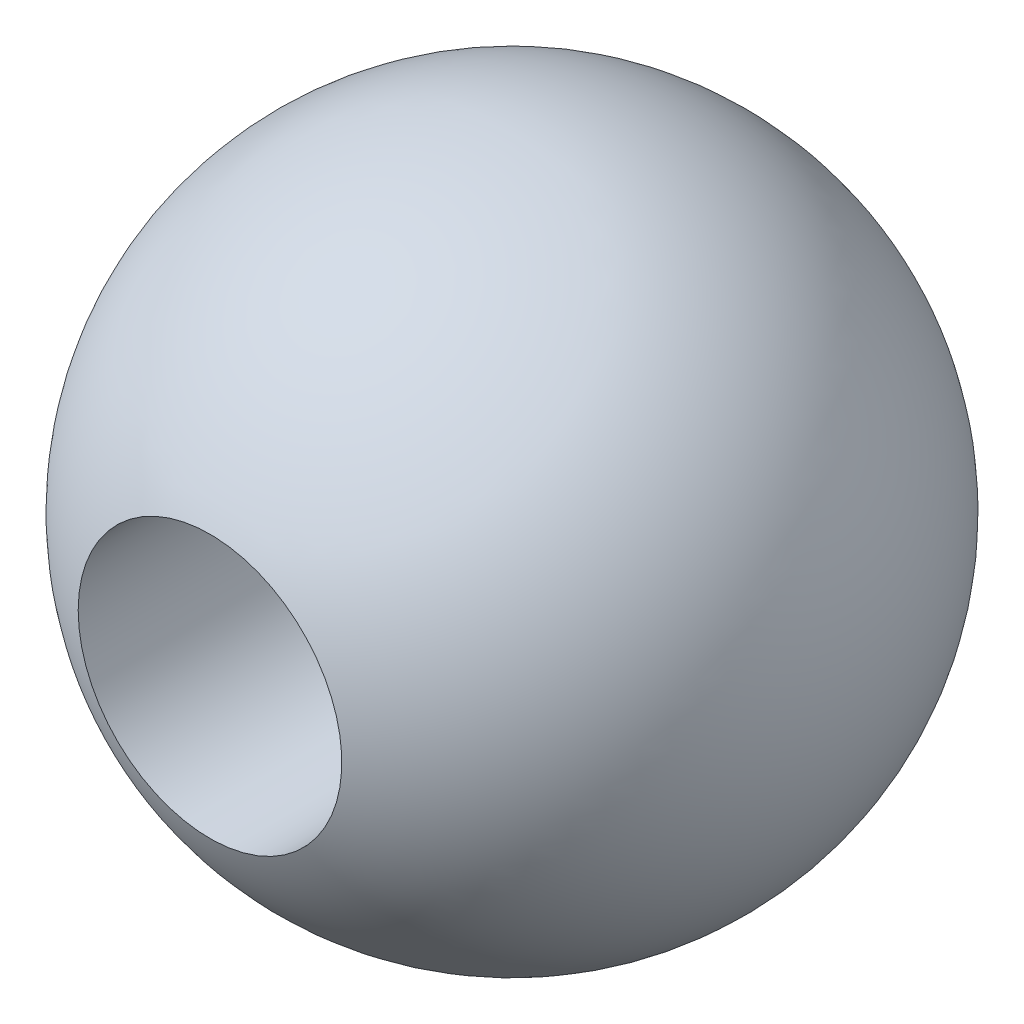
ISO-10303-21;
HEADER;
FILE_DESCRIPTION(('STEP AP214'),'2;1');
FILE_NAME('part.step','',(''),(''),'','','');
FILE_SCHEMA(('AUTOMOTIVE_DESIGN { 1 0 10303 214 1 1 1 1 }'));
ENDSEC;
DATA;
#1=APPLICATION_CONTEXT('core data for automotive mechanical design processes');
#2=APPLICATION_PROTOCOL_DEFINITION('international standard','automotive_design',2000,#1);
#3=PRODUCT_CONTEXT('',#1,'mechanical');
#4=PRODUCT('Part','Part','',(#3));
#5=PRODUCT_RELATED_PRODUCT_CATEGORY('part','',(#4));
#6=PRODUCT_DEFINITION_FORMATION('','',#4);
#7=PRODUCT_DEFINITION_CONTEXT('part definition',#1,'design');
#8=PRODUCT_DEFINITION('design','',#6,#7);
#9=PRODUCT_DEFINITION_SHAPE('','',#8);
#10=(LENGTH_UNIT() NAMED_UNIT(*) SI_UNIT(.MILLI.,.METRE.));
#11=(NAMED_UNIT(*) PLANE_ANGLE_UNIT() SI_UNIT($,.RADIAN.));
#12=(NAMED_UNIT(*) SI_UNIT($,.STERADIAN.) SOLID_ANGLE_UNIT());
#13=UNCERTAINTY_MEASURE_WITH_UNIT(LENGTH_MEASURE(1.E-05),#10,'distance_accuracy_value','');
#14=(GEOMETRIC_REPRESENTATION_CONTEXT(3) GLOBAL_UNCERTAINTY_ASSIGNED_CONTEXT((#13)) GLOBAL_UNIT_ASSIGNED_CONTEXT((#10,
#11,#12)) REPRESENTATION_CONTEXT('',''));
#15=CARTESIAN_POINT('',(0.,0.,0.));
#16=DIRECTION('',(0.,0.,1.));
#17=DIRECTION('',(1.,0.,0.));
#18=AXIS2_PLACEMENT_3D('',#15,#16,#17);
#19=CARTESIAN_POINT('',(0.,0.,0.));
#20=DIRECTION('',(0.,1.,0.));
#21=DIRECTION('',(1.,0.,0.));
#22=AXIS2_PLACEMENT_3D('',#19,#20,#21);
#23=SPHERICAL_SURFACE('',#22,6.35);
#24=CARTESIAN_POINT('',(0.,0.,0.));
#25=DIRECTION('',(0.,0.,-1.));
#26=DIRECTION('',(-1.,0.,0.));
#27=AXIS2_PLACEMENT_3D('',#24,#25,#26);
#28=SPHERICAL_SURFACE('',#27,6.35);
#29=CARTESIAN_POINT('',(0.,0.,5.81987113259392));
#30=DIRECTION('',(0.,0.,-1.));
#31=DIRECTION('',(-1.,0.,0.));
#32=AXIS2_PLACEMENT_3D('',#29,#30,#31);
#33=CIRCLE('',#32,2.54);
#34=CARTESIAN_POINT('',(-2.54,0.,5.81987113259392));
#35=VERTEX_POINT('',#34);
#36=EDGE_CURVE('E10',#35,#35,#33,.T.);
#37=ORIENTED_EDGE('',*,*,#36,.T.);
#38=EDGE_LOOP('',(#37));
#39=FACE_BOUND('',#38,.T.);
#40=CARTESIAN_POINT('',(0.,0.,-5.81987113259392));
#41=DIRECTION('',(0.,0.,1.));
#42=DIRECTION('',(1.,0.,0.));
#43=AXIS2_PLACEMENT_3D('',#40,#41,#42);
#44=CIRCLE('',#43,2.54);
#45=CARTESIAN_POINT('',(2.54,0.,-5.81987113259392));
#46=VERTEX_POINT('',#45);
#47=EDGE_CURVE('E36',#46,#46,#44,.T.);
#48=ORIENTED_EDGE('',*,*,#47,.T.);
#49=EDGE_LOOP('',(#48));
#50=FACE_BOUND('',#49,.T.);
#51=ADVANCED_FACE('F30',(#39,#50),#28,.T.);
#52=CARTESIAN_POINT('',(0.,0.,-6.35));
#53=DIRECTION('',(0.,0.,1.));
#54=DIRECTION('',(1.,0.,0.));
#55=AXIS2_PLACEMENT_3D('',#52,#53,#54);
#56=CYLINDRICAL_SURFACE('',#55,2.54);
#57=ORIENTED_EDGE('',*,*,#47,.F.);
#58=EDGE_LOOP('',(#57));
#59=FACE_BOUND('',#58,.T.);
#60=ORIENTED_EDGE('',*,*,#36,.F.);
#61=EDGE_LOOP('',(#60));
#62=FACE_BOUND('',#61,.T.);
#63=ADVANCED_FACE('F43',(#59,#62),#56,.F.);
#64=CLOSED_SHELL('',(#51,#63));
#65=MANIFOLD_SOLID_BREP('B2',#64);
#66=ADVANCED_BREP_SHAPE_REPRESENTATION('',(#18,#65),#14);
#67=SHAPE_DEFINITION_REPRESENTATION(#9,#66);
ENDSEC;
END-ISO-10303-21;
